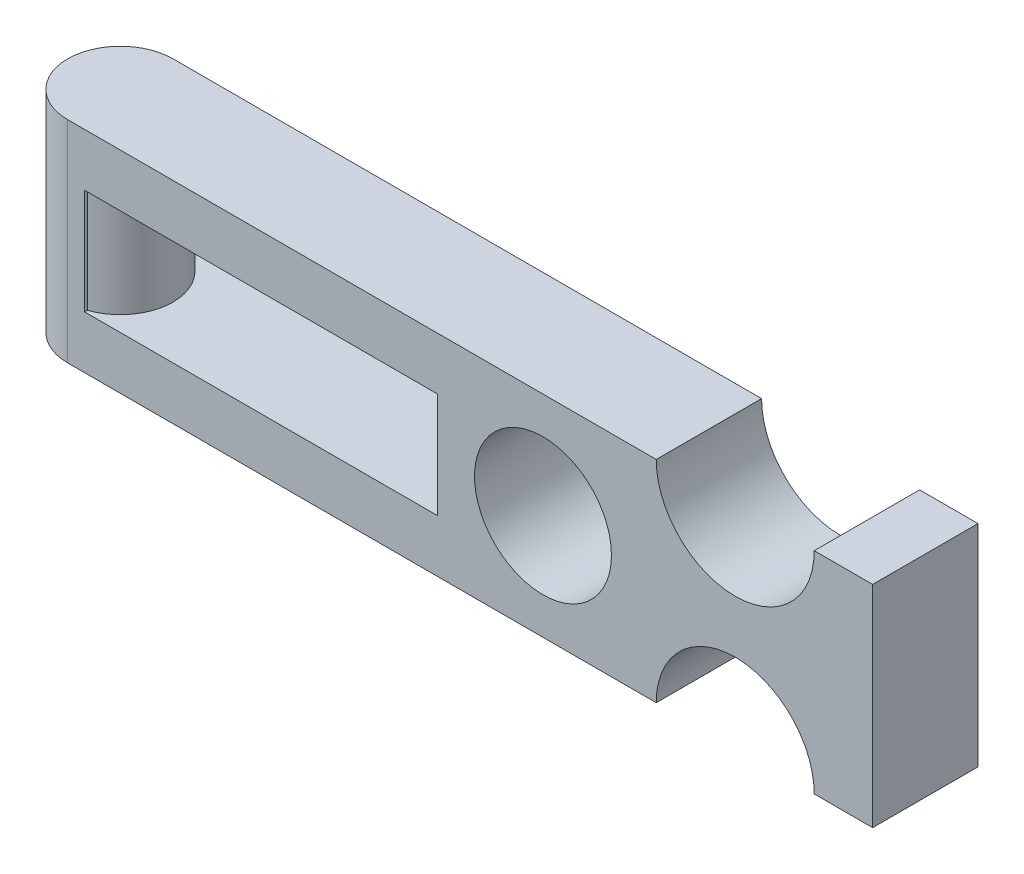
ISO-10303-21;
HEADER;
FILE_DESCRIPTION(('STEP AP214'),'2;1');
FILE_NAME('part.step','',(''),(''),'','','');
FILE_SCHEMA(('AUTOMOTIVE_DESIGN { 1 0 10303 214 1 1 1 1 }'));
ENDSEC;
DATA;
#1=APPLICATION_CONTEXT('core data for automotive mechanical design processes');
#2=APPLICATION_PROTOCOL_DEFINITION('international standard','automotive_design',2000,#1);
#3=PRODUCT_CONTEXT('',#1,'mechanical');
#4=PRODUCT('Part','Part','',(#3));
#5=PRODUCT_RELATED_PRODUCT_CATEGORY('part','',(#4));
#6=PRODUCT_DEFINITION_FORMATION('','',#4);
#7=PRODUCT_DEFINITION_CONTEXT('part definition',#1,'design');
#8=PRODUCT_DEFINITION('design','',#6,#7);
#9=PRODUCT_DEFINITION_SHAPE('','',#8);
#10=(LENGTH_UNIT() NAMED_UNIT(*) SI_UNIT(.MILLI.,.METRE.));
#11=(NAMED_UNIT(*) PLANE_ANGLE_UNIT() SI_UNIT($,.RADIAN.));
#12=(NAMED_UNIT(*) SI_UNIT($,.STERADIAN.) SOLID_ANGLE_UNIT());
#13=UNCERTAINTY_MEASURE_WITH_UNIT(LENGTH_MEASURE(1.E-05),#10,'distance_accuracy_value','');
#14=(GEOMETRIC_REPRESENTATION_CONTEXT(3) GLOBAL_UNCERTAINTY_ASSIGNED_CONTEXT((#13)) GLOBAL_UNIT_ASSIGNED_CONTEXT((#10,
#11,#12)) REPRESENTATION_CONTEXT('',''));
#15=CARTESIAN_POINT('',(0.,0.,0.));
#16=DIRECTION('',(0.,0.,1.));
#17=DIRECTION('',(1.,0.,0.));
#18=AXIS2_PLACEMENT_3D('',#15,#16,#17);
#19=CARTESIAN_POINT('',(2.03711644146193,6.35,12.7));
#20=DIRECTION('',(1.,0.,0.));
#21=DIRECTION('',(0.,0.,-1.));
#22=AXIS2_PLACEMENT_3D('',#19,#20,#21);
#23=PLANE('',#22);
#24=DIRECTION('',(0.,1.,0.));
#25=VECTOR('',#24,1.);
#26=CARTESIAN_POINT('',(2.03711644146193,-12.7,0.335629159760307));
#27=LINE('',#26,#25);
#28=CARTESIAN_POINT('',(2.03711644146193,-6.35,0.335629159760307));
#29=VERTEX_POINT('',#28);
#30=CARTESIAN_POINT('',(2.03711644146193,6.35,0.335629159760307));
#31=VERTEX_POINT('',#30);
#32=EDGE_CURVE('E49',#29,#31,#27,.T.);
#33=ORIENTED_EDGE('',*,*,#32,.F.);
#34=DIRECTION('',(0.,0.,-1.));
#35=VECTOR('',#34,1.);
#36=CARTESIAN_POINT('',(2.03711644146193,-6.35,12.7));
#37=LINE('',#36,#35);
#38=CARTESIAN_POINT('',(2.03711644146193,-6.35,0.));
#39=VERTEX_POINT('',#38);
#40=EDGE_CURVE('E202',#29,#39,#37,.T.);
#41=ORIENTED_EDGE('',*,*,#40,.T.);
#42=DIRECTION('',(0.,-1.,0.));
#43=VECTOR('',#42,1.);
#44=CARTESIAN_POINT('',(2.03711644146193,6.35,0.));
#45=LINE('',#44,#43);
#46=CARTESIAN_POINT('',(2.03711644146193,6.35,0.));
#47=VERTEX_POINT('',#46);
#48=EDGE_CURVE('E174',#47,#39,#45,.T.);
#49=ORIENTED_EDGE('',*,*,#48,.F.);
#50=DIRECTION('',(0.,0.,-1.));
#51=VECTOR('',#50,1.);
#52=CARTESIAN_POINT('',(2.03711644146193,6.35,12.7));
#53=LINE('',#52,#51);
#54=EDGE_CURVE('E185',#31,#47,#53,.T.);
#55=ORIENTED_EDGE('',*,*,#54,.F.);
#56=EDGE_LOOP('',(#33,#41,#49,#55));
#57=FACE_BOUND('',#56,.T.);
#58=ADVANCED_FACE('F34',(#57),#23,.T.);
#59=CARTESIAN_POINT('',(80.4741849339736,-12.7,12.7));
#60=DIRECTION('',(0.,0.,1.));
#61=DIRECTION('',(1.,0.,0.));
#62=AXIS2_PLACEMENT_3D('',#59,#60,#61);
#63=PLANE('',#62);
#64=DIRECTION('',(0.,-1.,0.));
#65=VECTOR('',#64,1.);
#66=CARTESIAN_POINT('',(0.,12.7,12.7));
#67=LINE('',#66,#65);
#68=CARTESIAN_POINT('',(0.,12.7,12.7));
#69=VERTEX_POINT('',#68);
#70=CARTESIAN_POINT('',(0.,-12.7,12.7));
#71=VERTEX_POINT('',#70);
#72=EDGE_CURVE('E159',#69,#71,#67,.T.);
#73=ORIENTED_EDGE('',*,*,#72,.T.);
#74=DIRECTION('',(1.,0.,0.));
#75=VECTOR('',#74,1.);
#76=CARTESIAN_POINT('',(0.,-12.7,12.7));
#77=LINE('',#76,#75);
#78=CARTESIAN_POINT('',(70.9491849339736,-12.7,12.7));
#79=VERTEX_POINT('',#78);
#80=EDGE_CURVE('E211',#71,#79,#77,.T.);
#81=ORIENTED_EDGE('',*,*,#80,.T.);
#82=CARTESIAN_POINT('',(80.4741849339736,-12.7,12.7));
#83=DIRECTION('',(0.,0.,-1.));
#84=DIRECTION('',(1.,0.,0.));
#85=AXIS2_PLACEMENT_3D('',#82,#83,#84);
#86=CIRCLE('',#85,9.52500000000001);
#87=CARTESIAN_POINT('',(89.9991849339736,-12.7,12.7));
#88=VERTEX_POINT('',#87);
#89=EDGE_CURVE('E213',#79,#88,#86,.T.);
#90=ORIENTED_EDGE('',*,*,#89,.T.);
#91=DIRECTION('',(1.,0.,0.));
#92=VECTOR('',#91,1.);
#93=CARTESIAN_POINT('',(89.9991849339736,-12.7,12.7));
#94=LINE('',#93,#92);
#95=CARTESIAN_POINT('',(97.04,-12.7,12.7));
#96=VERTEX_POINT('',#95);
#97=EDGE_CURVE('E215',#88,#96,#94,.T.);
#98=ORIENTED_EDGE('',*,*,#97,.T.);
#99=DIRECTION('',(0.,1.,0.));
#100=VECTOR('',#99,1.);
#101=CARTESIAN_POINT('',(97.04,12.7,12.7));
#102=LINE('',#101,#100);
#103=CARTESIAN_POINT('',(97.04,12.7,12.7));
#104=VERTEX_POINT('',#103);
#105=EDGE_CURVE('E217',#96,#104,#102,.T.);
#106=ORIENTED_EDGE('',*,*,#105,.T.);
#107=DIRECTION('',(-1.,0.,0.));
#108=VECTOR('',#107,1.);
#109=CARTESIAN_POINT('',(89.9991849339736,12.7,12.7));
#110=LINE('',#109,#108);
#111=CARTESIAN_POINT('',(89.9991849339736,12.7,12.7));
#112=VERTEX_POINT('',#111);
#113=EDGE_CURVE('E219',#104,#112,#110,.T.);
#114=ORIENTED_EDGE('',*,*,#113,.T.);
#115=CARTESIAN_POINT('',(80.4741849339736,12.7,12.7));
#116=DIRECTION('',(0.,0.,-1.));
#117=DIRECTION('',(1.,0.,0.));
#118=AXIS2_PLACEMENT_3D('',#115,#116,#117);
#119=CIRCLE('',#118,9.52500000000001);
#120=CARTESIAN_POINT('',(70.9491849339736,12.7,12.7));
#121=VERTEX_POINT('',#120);
#122=EDGE_CURVE('E221',#112,#121,#119,.T.);
#123=ORIENTED_EDGE('',*,*,#122,.T.);
#124=DIRECTION('',(-1.,0.,0.));
#125=VECTOR('',#124,1.);
#126=CARTESIAN_POINT('',(0.,12.7,12.7));
#127=LINE('',#126,#125);
#128=EDGE_CURVE('E223',#121,#69,#127,.T.);
#129=ORIENTED_EDGE('',*,*,#128,.T.);
#130=EDGE_LOOP('',(#73,#81,#90,#98,#106,#114,#123,#129));
#131=FACE_BOUND('',#130,.T.);
#132=CARTESIAN_POINT('',(57.297,0.,12.7));
#133=DIRECTION('',(0.,0.,1.));
#134=DIRECTION('',(1.,0.,0.));
#135=AXIS2_PLACEMENT_3D('',#132,#133,#134);
#136=CIRCLE('',#135,8.25500000000001);
#137=CARTESIAN_POINT('',(65.552,0.,12.7));
#138=VERTEX_POINT('',#137);
#139=EDGE_CURVE('E149',#138,#138,#136,.T.);
#140=ORIENTED_EDGE('',*,*,#139,.F.);
#141=EDGE_LOOP('',(#140));
#142=FACE_BOUND('',#141,.T.);
#143=DIRECTION('',(1.,0.,0.));
#144=VECTOR('',#143,1.);
#145=CARTESIAN_POINT('',(2.03711644146193,-6.35,12.7));
#146=LINE('',#145,#144);
#147=CARTESIAN_POINT('',(2.03711644146193,-6.35,12.7));
#148=VERTEX_POINT('',#147);
#149=CARTESIAN_POINT('',(44.5665686648635,-6.35,12.7));
#150=VERTEX_POINT('',#149);
#151=EDGE_CURVE('E177',#148,#150,#146,.T.);
#152=ORIENTED_EDGE('',*,*,#151,.F.);
#153=DIRECTION('',(0.,-1.,0.));
#154=VECTOR('',#153,1.);
#155=CARTESIAN_POINT('',(2.03711644146193,6.35,12.7));
#156=LINE('',#155,#154);
#157=CARTESIAN_POINT('',(2.03711644146193,6.35,12.7));
#158=VERTEX_POINT('',#157);
#159=EDGE_CURVE('E175',#158,#148,#156,.T.);
#160=ORIENTED_EDGE('',*,*,#159,.F.);
#161=DIRECTION('',(-1.,0.,0.));
#162=VECTOR('',#161,1.);
#163=CARTESIAN_POINT('',(2.03711644146193,6.35,12.7));
#164=LINE('',#163,#162);
#165=CARTESIAN_POINT('',(44.5665686648635,6.35,12.7));
#166=VERTEX_POINT('',#165);
#167=EDGE_CURVE('E183',#166,#158,#164,.T.);
#168=ORIENTED_EDGE('',*,*,#167,.F.);
#169=DIRECTION('',(0.,1.,0.));
#170=VECTOR('',#169,1.);
#171=CARTESIAN_POINT('',(44.5665686648635,6.35,12.7));
#172=LINE('',#171,#170);
#173=EDGE_CURVE('E180',#150,#166,#172,.T.);
#174=ORIENTED_EDGE('',*,*,#173,.F.);
#175=EDGE_LOOP('',(#152,#160,#168,#174));
#176=FACE_BOUND('',#175,.T.);
#177=ADVANCED_FACE('F267',(#131,#142,#176),#63,.T.);
#178=CARTESIAN_POINT('',(80.4741849339736,-12.7,0.));
#179=DIRECTION('',(0.,0.,1.));
#180=DIRECTION('',(1.,0.,0.));
#181=AXIS2_PLACEMENT_3D('',#178,#179,#180);
#182=PLANE('',#181);
#183=CARTESIAN_POINT('',(57.297,0.,0.));
#184=DIRECTION('',(0.,0.,1.));
#185=DIRECTION('',(1.,0.,0.));
#186=AXIS2_PLACEMENT_3D('',#183,#184,#185);
#187=CIRCLE('',#186,8.25500000000001);
#188=CARTESIAN_POINT('',(65.552,0.,0.));
#189=VERTEX_POINT('',#188);
#190=EDGE_CURVE('E205',#189,#189,#187,.T.);
#191=ORIENTED_EDGE('',*,*,#190,.T.);
#192=EDGE_LOOP('',(#191));
#193=FACE_BOUND('',#192,.T.);
#194=DIRECTION('',(0.,-1.,0.));
#195=VECTOR('',#194,1.);
#196=CARTESIAN_POINT('',(0.,12.7,0.));
#197=LINE('',#196,#195);
#198=CARTESIAN_POINT('',(0.,12.7,0.));
#199=VERTEX_POINT('',#198);
#200=CARTESIAN_POINT('',(0.,-12.7,0.));
#201=VERTEX_POINT('',#200);
#202=EDGE_CURVE('E137',#199,#201,#197,.T.);
#203=ORIENTED_EDGE('',*,*,#202,.F.);
#204=DIRECTION('',(-1.,0.,0.));
#205=VECTOR('',#204,1.);
#206=CARTESIAN_POINT('',(0.,12.7,0.));
#207=LINE('',#206,#205);
#208=CARTESIAN_POINT('',(70.9491849339736,12.7,0.));
#209=VERTEX_POINT('',#208);
#210=EDGE_CURVE('E142',#209,#199,#207,.T.);
#211=ORIENTED_EDGE('',*,*,#210,.F.);
#212=CARTESIAN_POINT('',(80.4741849339736,12.7,0.));
#213=DIRECTION('',(0.,0.,-1.));
#214=DIRECTION('',(1.,0.,0.));
#215=AXIS2_PLACEMENT_3D('',#212,#213,#214);
#216=CIRCLE('',#215,9.52500000000001);
#217=CARTESIAN_POINT('',(89.9991849339736,12.7,0.));
#218=VERTEX_POINT('',#217);
#219=EDGE_CURVE('E160',#218,#209,#216,.T.);
#220=ORIENTED_EDGE('',*,*,#219,.F.);
#221=DIRECTION('',(-1.,0.,0.));
#222=VECTOR('',#221,1.);
#223=CARTESIAN_POINT('',(89.9991849339736,12.7,0.));
#224=LINE('',#223,#222);
#225=CARTESIAN_POINT('',(97.04,12.7,0.));
#226=VERTEX_POINT('',#225);
#227=EDGE_CURVE('E232',#226,#218,#224,.T.);
#228=ORIENTED_EDGE('',*,*,#227,.F.);
#229=DIRECTION('',(0.,1.,0.));
#230=VECTOR('',#229,1.);
#231=CARTESIAN_POINT('',(97.04,12.7,0.));
#232=LINE('',#231,#230);
#233=CARTESIAN_POINT('',(97.04,-12.7,0.));
#234=VERTEX_POINT('',#233);
#235=EDGE_CURVE('E230',#234,#226,#232,.T.);
#236=ORIENTED_EDGE('',*,*,#235,.F.);
#237=DIRECTION('',(1.,0.,0.));
#238=VECTOR('',#237,1.);
#239=CARTESIAN_POINT('',(89.9991849339736,-12.7,0.));
#240=LINE('',#239,#238);
#241=CARTESIAN_POINT('',(89.9991849339736,-12.7,0.));
#242=VERTEX_POINT('',#241);
#243=EDGE_CURVE('E228',#242,#234,#240,.T.);
#244=ORIENTED_EDGE('',*,*,#243,.F.);
#245=CARTESIAN_POINT('',(80.4741849339736,-12.7,0.));
#246=DIRECTION('',(0.,0.,-1.));
#247=DIRECTION('',(1.,0.,0.));
#248=AXIS2_PLACEMENT_3D('',#245,#246,#247);
#249=CIRCLE('',#248,9.52500000000001);
#250=CARTESIAN_POINT('',(70.9491849339736,-12.7,0.));
#251=VERTEX_POINT('',#250);
#252=EDGE_CURVE('E226',#251,#242,#249,.T.);
#253=ORIENTED_EDGE('',*,*,#252,.F.);
#254=DIRECTION('',(1.,0.,0.));
#255=VECTOR('',#254,1.);
#256=CARTESIAN_POINT('',(0.,-12.7,0.));
#257=LINE('',#256,#255);
#258=EDGE_CURVE('E144',#201,#251,#257,.T.);
#259=ORIENTED_EDGE('',*,*,#258,.F.);
#260=EDGE_LOOP('',(#203,#211,#220,#228,#236,#244,#253,#259));
#261=FACE_BOUND('',#260,.T.);
#262=ORIENTED_EDGE('',*,*,#48,.T.);
#263=DIRECTION('',(1.,0.,0.));
#264=VECTOR('',#263,1.);
#265=CARTESIAN_POINT('',(2.03711644146193,-6.35,0.));
#266=LINE('',#265,#264);
#267=CARTESIAN_POINT('',(44.5665686648635,-6.35,0.));
#268=VERTEX_POINT('',#267);
#269=EDGE_CURVE('E188',#39,#268,#266,.T.);
#270=ORIENTED_EDGE('',*,*,#269,.T.);
#271=DIRECTION('',(0.,1.,0.));
#272=VECTOR('',#271,1.);
#273=CARTESIAN_POINT('',(44.5665686648635,6.35,0.));
#274=LINE('',#273,#272);
#275=CARTESIAN_POINT('',(44.5665686648635,6.35,0.));
#276=VERTEX_POINT('',#275);
#277=EDGE_CURVE('E191',#268,#276,#274,.T.);
#278=ORIENTED_EDGE('',*,*,#277,.T.);
#279=DIRECTION('',(-1.,0.,0.));
#280=VECTOR('',#279,1.);
#281=CARTESIAN_POINT('',(2.03711644146193,6.35,0.));
#282=LINE('',#281,#280);
#283=EDGE_CURVE('E178',#276,#47,#282,.T.);
#284=ORIENTED_EDGE('',*,*,#283,.T.);
#285=EDGE_LOOP('',(#262,#270,#278,#284));
#286=FACE_BOUND('',#285,.T.);
#287=ADVANCED_FACE('F139',(#193,#261,#286),#182,.F.);
#288=CARTESIAN_POINT('',(0.,-12.7,12.7));
#289=DIRECTION('',(0.,1.,0.));
#290=DIRECTION('',(0.,0.,1.));
#291=AXIS2_PLACEMENT_3D('',#288,#289,#290);
#292=PLANE('',#291);
#293=ORIENTED_EDGE('',*,*,#80,.F.);
#294=CARTESIAN_POINT('',(0.,-12.7,6.35));
#295=DIRECTION('',(0.,1.,0.));
#296=DIRECTION('',(0.,0.,1.));
#297=AXIS2_PLACEMENT_3D('',#294,#295,#296);
#298=CIRCLE('',#297,6.35);
#299=EDGE_CURVE('E165',#201,#71,#298,.T.);
#300=ORIENTED_EDGE('',*,*,#299,.F.);
#301=ORIENTED_EDGE('',*,*,#258,.T.);
#302=DIRECTION('',(0.,0.,-1.));
#303=VECTOR('',#302,1.);
#304=CARTESIAN_POINT('',(70.9491849339736,-12.7,12.7));
#305=LINE('',#304,#303);
#306=EDGE_CURVE('E42',#79,#251,#305,.T.);
#307=ORIENTED_EDGE('',*,*,#306,.F.);
#308=EDGE_LOOP('',(#293,#300,#301,#307));
#309=FACE_BOUND('',#308,.T.);
#310=ADVANCED_FACE('F36',(#309),#292,.F.);
#311=CARTESIAN_POINT('',(80.4741849339736,-12.7,12.7));
#312=DIRECTION('',(0.,0.,-1.));
#313=DIRECTION('',(-1.,0.,0.));
#314=AXIS2_PLACEMENT_3D('',#311,#312,#313);
#315=CYLINDRICAL_SURFACE('',#314,9.52500000000001);
#316=ORIENTED_EDGE('',*,*,#252,.T.);
#317=DIRECTION('',(0.,0.,-1.));
#318=VECTOR('',#317,1.);
#319=CARTESIAN_POINT('',(89.9991849339736,-12.7,12.7));
#320=LINE('',#319,#318);
#321=EDGE_CURVE('E245',#88,#242,#320,.T.);
#322=ORIENTED_EDGE('',*,*,#321,.F.);
#323=ORIENTED_EDGE('',*,*,#89,.F.);
#324=ORIENTED_EDGE('',*,*,#306,.T.);
#325=EDGE_LOOP('',(#316,#322,#323,#324));
#326=FACE_BOUND('',#325,.T.);
#327=ADVANCED_FACE('F251',(#326),#315,.F.);
#328=CARTESIAN_POINT('',(89.9991849339736,-12.7,12.7));
#329=DIRECTION('',(0.,1.,0.));
#330=DIRECTION('',(0.,0.,1.));
#331=AXIS2_PLACEMENT_3D('',#328,#329,#330);
#332=PLANE('',#331);
#333=ORIENTED_EDGE('',*,*,#243,.T.);
#334=DIRECTION('',(0.,0.,-1.));
#335=VECTOR('',#334,1.);
#336=CARTESIAN_POINT('',(97.04,-12.7,12.7));
#337=LINE('',#336,#335);
#338=EDGE_CURVE('E242',#96,#234,#337,.T.);
#339=ORIENTED_EDGE('',*,*,#338,.F.);
#340=ORIENTED_EDGE('',*,*,#97,.F.);
#341=ORIENTED_EDGE('',*,*,#321,.T.);
#342=EDGE_LOOP('',(#333,#339,#340,#341));
#343=FACE_BOUND('',#342,.T.);
#344=ADVANCED_FACE('F259',(#343),#332,.F.);
#345=CARTESIAN_POINT('',(97.04,12.7,12.7));
#346=DIRECTION('',(-1.,0.,0.));
#347=DIRECTION('',(0.,0.,1.));
#348=AXIS2_PLACEMENT_3D('',#345,#346,#347);
#349=PLANE('',#348);
#350=ORIENTED_EDGE('',*,*,#235,.T.);
#351=DIRECTION('',(0.,0.,-1.));
#352=VECTOR('',#351,1.);
#353=CARTESIAN_POINT('',(97.04,12.7,12.7));
#354=LINE('',#353,#352);
#355=EDGE_CURVE('E239',#104,#226,#354,.T.);
#356=ORIENTED_EDGE('',*,*,#355,.F.);
#357=ORIENTED_EDGE('',*,*,#105,.F.);
#358=ORIENTED_EDGE('',*,*,#338,.T.);
#359=EDGE_LOOP('',(#350,#356,#357,#358));
#360=FACE_BOUND('',#359,.T.);
#361=ADVANCED_FACE('F263',(#360),#349,.F.);
#362=CARTESIAN_POINT('',(89.9991849339736,12.7,12.7));
#363=DIRECTION('',(0.,-1.,0.));
#364=DIRECTION('',(0.,0.,-1.));
#365=AXIS2_PLACEMENT_3D('',#362,#363,#364);
#366=PLANE('',#365);
#367=ORIENTED_EDGE('',*,*,#227,.T.);
#368=DIRECTION('',(0.,0.,-1.));
#369=VECTOR('',#368,1.);
#370=CARTESIAN_POINT('',(89.9991849339736,12.7,12.7));
#371=LINE('',#370,#369);
#372=EDGE_CURVE('E236',#112,#218,#371,.T.);
#373=ORIENTED_EDGE('',*,*,#372,.F.);
#374=ORIENTED_EDGE('',*,*,#113,.F.);
#375=ORIENTED_EDGE('',*,*,#355,.T.);
#376=EDGE_LOOP('',(#367,#373,#374,#375));
#377=FACE_BOUND('',#376,.T.);
#378=ADVANCED_FACE('F396',(#377),#366,.F.);
#379=CARTESIAN_POINT('',(80.4741849339736,12.7,12.7));
#380=DIRECTION('',(0.,0.,-1.));
#381=DIRECTION('',(-1.,0.,0.));
#382=AXIS2_PLACEMENT_3D('',#379,#380,#381);
#383=CYLINDRICAL_SURFACE('',#382,9.52500000000001);
#384=ORIENTED_EDGE('',*,*,#219,.T.);
#385=DIRECTION('',(0.,0.,-1.));
#386=VECTOR('',#385,1.);
#387=CARTESIAN_POINT('',(70.9491849339736,12.7,12.7));
#388=LINE('',#387,#386);
#389=EDGE_CURVE('E158',#121,#209,#388,.T.);
#390=ORIENTED_EDGE('',*,*,#389,.F.);
#391=ORIENTED_EDGE('',*,*,#122,.F.);
#392=ORIENTED_EDGE('',*,*,#372,.T.);
#393=EDGE_LOOP('',(#384,#390,#391,#392));
#394=FACE_BOUND('',#393,.T.);
#395=ADVANCED_FACE('F357',(#394),#383,.F.);
#396=CARTESIAN_POINT('',(0.,12.7,12.7));
#397=DIRECTION('',(0.,-1.,0.));
#398=DIRECTION('',(0.,0.,-1.));
#399=AXIS2_PLACEMENT_3D('',#396,#397,#398);
#400=PLANE('',#399);
#401=ORIENTED_EDGE('',*,*,#210,.T.);
#402=CARTESIAN_POINT('',(0.,12.7,6.35));
#403=DIRECTION('',(0.,1.,0.));
#404=DIRECTION('',(0.,0.,1.));
#405=AXIS2_PLACEMENT_3D('',#402,#403,#404);
#406=CIRCLE('',#405,6.35);
#407=EDGE_CURVE('E156',#199,#69,#406,.T.);
#408=ORIENTED_EDGE('',*,*,#407,.T.);
#409=ORIENTED_EDGE('',*,*,#128,.F.);
#410=ORIENTED_EDGE('',*,*,#389,.T.);
#411=EDGE_LOOP('',(#401,#408,#409,#410));
#412=FACE_BOUND('',#411,.T.);
#413=ADVANCED_FACE('F154',(#412),#400,.F.);
#414=CARTESIAN_POINT('',(57.297,0.,12.7));
#415=DIRECTION('',(0.,0.,-1.));
#416=DIRECTION('',(-1.,0.,0.));
#417=AXIS2_PLACEMENT_3D('',#414,#415,#416);
#418=CYLINDRICAL_SURFACE('',#417,8.25500000000001);
#419=ORIENTED_EDGE('',*,*,#139,.T.);
#420=EDGE_LOOP('',(#419));
#421=FACE_BOUND('',#420,.T.);
#422=ORIENTED_EDGE('',*,*,#190,.F.);
#423=EDGE_LOOP('',(#422));
#424=FACE_BOUND('',#423,.T.);
#425=ADVANCED_FACE('F288',(#421,#424),#418,.F.);
#426=DIRECTION('',(0.,1.,0.));
#427=VECTOR('',#426,1.);
#428=CARTESIAN_POINT('',(2.03711644146193,-12.7,12.3643708402397));
#429=LINE('',#428,#427);
#430=CARTESIAN_POINT('',(2.03711644146193,6.35,12.3643708402397));
#431=VERTEX_POINT('',#430);
#432=CARTESIAN_POINT('',(2.03711644146193,-6.35,12.3643708402397));
#433=VERTEX_POINT('',#432);
#434=EDGE_CURVE('E167',#431,#433,#429,.F.);
#435=ORIENTED_EDGE('',*,*,#434,.F.);
#436=EDGE_CURVE('E196',#158,#431,#53,.T.);
#437=ORIENTED_EDGE('',*,*,#436,.F.);
#438=ORIENTED_EDGE('',*,*,#159,.T.);
#439=EDGE_CURVE('E203',#148,#433,#37,.T.);
#440=ORIENTED_EDGE('',*,*,#439,.T.);
#441=EDGE_LOOP('',(#435,#437,#438,#440));
#442=FACE_BOUND('',#441,.T.);
#443=ADVANCED_FACE('F279',(#442),#23,.T.);
#444=CARTESIAN_POINT('',(2.03711644146193,-6.35,12.7));
#445=DIRECTION('',(0.,1.,0.));
#446=DIRECTION('',(0.,0.,1.));
#447=AXIS2_PLACEMENT_3D('',#444,#445,#446);
#448=PLANE('',#447);
#449=CARTESIAN_POINT('',(0.,-6.35,6.35));
#450=DIRECTION('',(0.,1.,0.));
#451=DIRECTION('',(0.,0.,1.));
#452=AXIS2_PLACEMENT_3D('',#449,#450,#451);
#453=CIRCLE('',#452,6.35);
#454=EDGE_CURVE('E56',#433,#29,#453,.T.);
#455=ORIENTED_EDGE('',*,*,#454,.F.);
#456=ORIENTED_EDGE('',*,*,#439,.F.);
#457=ORIENTED_EDGE('',*,*,#151,.T.);
#458=DIRECTION('',(0.,0.,-1.));
#459=VECTOR('',#458,1.);
#460=CARTESIAN_POINT('',(44.5665686648635,-6.35,12.7));
#461=LINE('',#460,#459);
#462=EDGE_CURVE('E200',#150,#268,#461,.T.);
#463=ORIENTED_EDGE('',*,*,#462,.T.);
#464=ORIENTED_EDGE('',*,*,#269,.F.);
#465=ORIENTED_EDGE('',*,*,#40,.F.);
#466=EDGE_LOOP('',(#455,#456,#457,#463,#464,#465));
#467=FACE_BOUND('',#466,.T.);
#468=ADVANCED_FACE('F287',(#467),#448,.T.);
#469=CARTESIAN_POINT('',(44.5665686648635,6.35,12.7));
#470=DIRECTION('',(-1.,0.,0.));
#471=DIRECTION('',(0.,0.,1.));
#472=AXIS2_PLACEMENT_3D('',#469,#470,#471);
#473=PLANE('',#472);
#474=ORIENTED_EDGE('',*,*,#277,.F.);
#475=ORIENTED_EDGE('',*,*,#462,.F.);
#476=ORIENTED_EDGE('',*,*,#173,.T.);
#477=DIRECTION('',(0.,0.,-1.));
#478=VECTOR('',#477,1.);
#479=CARTESIAN_POINT('',(44.5665686648635,6.35,12.7));
#480=LINE('',#479,#478);
#481=EDGE_CURVE('E198',#166,#276,#480,.T.);
#482=ORIENTED_EDGE('',*,*,#481,.T.);
#483=EDGE_LOOP('',(#474,#475,#476,#482));
#484=FACE_BOUND('',#483,.T.);
#485=ADVANCED_FACE('F294',(#484),#473,.T.);
#486=CARTESIAN_POINT('',(2.03711644146193,6.35,12.7));
#487=DIRECTION('',(0.,-1.,0.));
#488=DIRECTION('',(0.,0.,-1.));
#489=AXIS2_PLACEMENT_3D('',#486,#487,#488);
#490=PLANE('',#489);
#491=CARTESIAN_POINT('',(0.,6.35,6.35));
#492=DIRECTION('',(0.,-1.,0.));
#493=DIRECTION('',(0.,0.,-1.));
#494=AXIS2_PLACEMENT_3D('',#491,#492,#493);
#495=CIRCLE('',#494,6.35);
#496=EDGE_CURVE('E11',#31,#431,#495,.T.);
#497=ORIENTED_EDGE('',*,*,#496,.F.);
#498=ORIENTED_EDGE('',*,*,#54,.T.);
#499=ORIENTED_EDGE('',*,*,#283,.F.);
#500=ORIENTED_EDGE('',*,*,#481,.F.);
#501=ORIENTED_EDGE('',*,*,#167,.T.);
#502=ORIENTED_EDGE('',*,*,#436,.T.);
#503=EDGE_LOOP('',(#497,#498,#499,#500,#501,#502));
#504=FACE_BOUND('',#503,.T.);
#505=ADVANCED_FACE('F302',(#504),#490,.T.);
#506=CARTESIAN_POINT('',(0.,-12.7,6.35));
#507=DIRECTION('',(0.,1.,0.));
#508=DIRECTION('',(0.,0.,1.));
#509=AXIS2_PLACEMENT_3D('',#506,#507,#508);
#510=CYLINDRICAL_SURFACE('',#509,6.35);
#511=ORIENTED_EDGE('',*,*,#434,.T.);
#512=ORIENTED_EDGE('',*,*,#454,.T.);
#513=ORIENTED_EDGE('',*,*,#32,.T.);
#514=ORIENTED_EDGE('',*,*,#496,.T.);
#515=EDGE_LOOP('',(#511,#512,#513,#514));
#516=FACE_BOUND('',#515,.T.);
#517=ADVANCED_FACE('F300',(#516),#510,.T.);
#518=ORIENTED_EDGE('',*,*,#202,.T.);
#519=ORIENTED_EDGE('',*,*,#299,.T.);
#520=ORIENTED_EDGE('',*,*,#72,.F.);
#521=ORIENTED_EDGE('',*,*,#407,.F.);
#522=EDGE_LOOP('',(#518,#519,#520,#521));
#523=FACE_BOUND('',#522,.T.);
#524=ADVANCED_FACE('F163',(#523),#510,.T.);
#525=CLOSED_SHELL('',(#58,#177,#287,#310,#327,#344,#361,#378,#395,#413,#425,#443,#468,#485,#505,
#517,#524));
#526=MANIFOLD_SOLID_BREP('B2',#525);
#527=ADVANCED_BREP_SHAPE_REPRESENTATION('',(#18,#526),#14);
#528=SHAPE_DEFINITION_REPRESENTATION(#9,#527);
ENDSEC;
END-ISO-10303-21;
